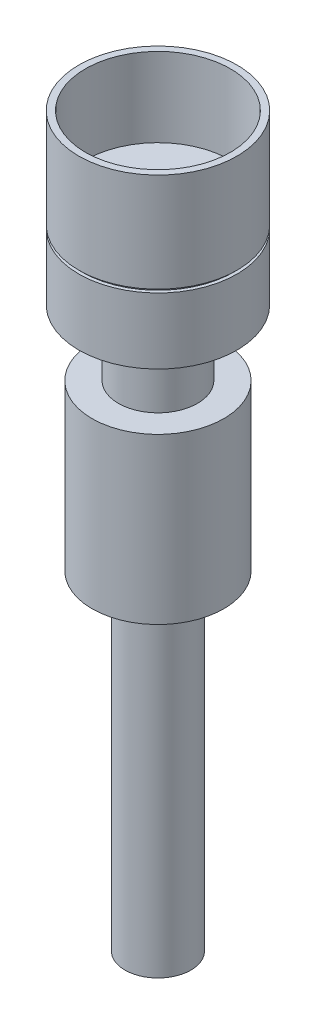
ISO-10303-21;
HEADER;
FILE_DESCRIPTION(('STEP AP214'),'2;1');
FILE_NAME('part.step','',(''),(''),'','','');
FILE_SCHEMA(('AUTOMOTIVE_DESIGN { 1 0 10303 214 1 1 1 1 }'));
ENDSEC;
DATA;
#1=APPLICATION_CONTEXT('core data for automotive mechanical design processes');
#2=APPLICATION_PROTOCOL_DEFINITION('international standard','automotive_design',2000,#1);
#3=PRODUCT_CONTEXT('',#1,'mechanical');
#4=PRODUCT('Part','Part','',(#3));
#5=PRODUCT_RELATED_PRODUCT_CATEGORY('part','',(#4));
#6=PRODUCT_DEFINITION_FORMATION('','',#4);
#7=PRODUCT_DEFINITION_CONTEXT('part definition',#1,'design');
#8=PRODUCT_DEFINITION('design','',#6,#7);
#9=PRODUCT_DEFINITION_SHAPE('','',#8);
#10=(LENGTH_UNIT() NAMED_UNIT(*) SI_UNIT(.MILLI.,.METRE.));
#11=(NAMED_UNIT(*) PLANE_ANGLE_UNIT() SI_UNIT($,.RADIAN.));
#12=(NAMED_UNIT(*) SI_UNIT($,.STERADIAN.) SOLID_ANGLE_UNIT());
#13=UNCERTAINTY_MEASURE_WITH_UNIT(LENGTH_MEASURE(1.E-05),#10,'distance_accuracy_value','');
#14=(GEOMETRIC_REPRESENTATION_CONTEXT(3) GLOBAL_UNCERTAINTY_ASSIGNED_CONTEXT((#13)) GLOBAL_UNIT_ASSIGNED_CONTEXT((#10,
#11,#12)) REPRESENTATION_CONTEXT('',''));
#15=CARTESIAN_POINT('',(0.,0.,0.));
#16=DIRECTION('',(0.,0.,1.));
#17=DIRECTION('',(1.,0.,0.));
#18=AXIS2_PLACEMENT_3D('',#15,#16,#17);
#19=CARTESIAN_POINT('',(0.,46.,0.));
#20=DIRECTION('',(0.,-1.,0.));
#21=DIRECTION('',(0.,0.,-1.));
#22=AXIS2_PLACEMENT_3D('',#19,#20,#21);
#23=CYLINDRICAL_SURFACE('',#22,11.5);
#24=CARTESIAN_POINT('',(0.,45.,0.));
#25=DIRECTION('',(0.,1.,0.));
#26=DIRECTION('',(0.,0.,1.));
#27=AXIS2_PLACEMENT_3D('',#24,#25,#26);
#28=CIRCLE('',#27,11.5);
#29=CARTESIAN_POINT('',(0.,45.,11.5));
#30=VERTEX_POINT('',#29);
#31=EDGE_CURVE('E63',#30,#30,#28,.T.);
#32=ORIENTED_EDGE('',*,*,#31,.T.);
#33=EDGE_LOOP('',(#32));
#34=FACE_BOUND('',#33,.T.);
#35=CARTESIAN_POINT('',(0.,45.5,0.));
#36=DIRECTION('',(0.,1.,0.));
#37=DIRECTION('',(0.,0.,1.));
#38=AXIS2_PLACEMENT_3D('',#35,#36,#37);
#39=CIRCLE('',#38,11.5);
#40=CARTESIAN_POINT('',(0.,45.5,11.5));
#41=VERTEX_POINT('',#40);
#42=EDGE_CURVE('E10',#41,#41,#39,.T.);
#43=ORIENTED_EDGE('',*,*,#42,.F.);
#44=EDGE_LOOP('',(#43));
#45=FACE_BOUND('',#44,.T.);
#46=ADVANCED_FACE('F30',(#34,#45),#23,.T.);
#47=CARTESIAN_POINT('',(0.,45.,0.));
#48=DIRECTION('',(0.,1.,0.));
#49=DIRECTION('',(0.,0.,1.));
#50=AXIS2_PLACEMENT_3D('',#47,#48,#49);
#51=PLANE('',#50);
#52=CARTESIAN_POINT('',(0.,45.,0.));
#53=DIRECTION('',(0.,1.,0.));
#54=DIRECTION('',(0.,0.,1.));
#55=AXIS2_PLACEMENT_3D('',#52,#53,#54);
#56=CIRCLE('',#55,12.);
#57=CARTESIAN_POINT('',(0.,45.,12.));
#58=VERTEX_POINT('',#57);
#59=EDGE_CURVE('E57',#58,#58,#56,.T.);
#60=ORIENTED_EDGE('',*,*,#59,.T.);
#61=EDGE_LOOP('',(#60));
#62=FACE_BOUND('',#61,.T.);
#63=ORIENTED_EDGE('',*,*,#31,.F.);
#64=EDGE_LOOP('',(#63));
#65=FACE_BOUND('',#64,.T.);
#66=ADVANCED_FACE('F112',(#62,#65),#51,.T.);
#67=CARTESIAN_POINT('',(0.,25.,0.));
#68=DIRECTION('',(0.,1.,0.));
#69=DIRECTION('',(0.,0.,1.));
#70=AXIS2_PLACEMENT_3D('',#67,#68,#69);
#71=PLANE('',#70);
#72=CARTESIAN_POINT('',(0.,25.,0.));
#73=DIRECTION('',(0.,1.,0.));
#74=DIRECTION('',(0.,0.,1.));
#75=AXIS2_PLACEMENT_3D('',#72,#73,#74);
#76=CIRCLE('',#75,10.);
#77=CARTESIAN_POINT('',(0.,25.,10.));
#78=VERTEX_POINT('',#77);
#79=EDGE_CURVE('E41',#78,#78,#76,.T.);
#80=ORIENTED_EDGE('',*,*,#79,.T.);
#81=EDGE_LOOP('',(#80));
#82=FACE_BOUND('',#81,.T.);
#83=CARTESIAN_POINT('',(0.,25.,0.));
#84=DIRECTION('',(0.,1.,0.));
#85=DIRECTION('',(0.,0.,1.));
#86=AXIS2_PLACEMENT_3D('',#83,#84,#85);
#87=CIRCLE('',#86,6.);
#88=CARTESIAN_POINT('',(0.,25.,6.));
#89=VERTEX_POINT('',#88);
#90=EDGE_CURVE('E54',#89,#89,#87,.T.);
#91=ORIENTED_EDGE('',*,*,#90,.F.);
#92=EDGE_LOOP('',(#91));
#93=FACE_BOUND('',#92,.T.);
#94=ADVANCED_FACE('F118',(#82,#93),#71,.T.);
#95=CARTESIAN_POINT('',(0.,0.,0.));
#96=DIRECTION('',(0.,1.,0.));
#97=DIRECTION('',(0.,0.,1.));
#98=AXIS2_PLACEMENT_3D('',#95,#96,#97);
#99=PLANE('',#98);
#100=CARTESIAN_POINT('',(0.,0.,0.));
#101=DIRECTION('',(0.,1.,0.));
#102=DIRECTION('',(0.,0.,1.));
#103=AXIS2_PLACEMENT_3D('',#100,#101,#102);
#104=CIRCLE('',#103,10.);
#105=CARTESIAN_POINT('',(0.,0.,10.));
#106=VERTEX_POINT('',#105);
#107=EDGE_CURVE('E45',#106,#106,#104,.T.);
#108=ORIENTED_EDGE('',*,*,#107,.F.);
#109=EDGE_LOOP('',(#108));
#110=FACE_BOUND('',#109,.T.);
#111=CARTESIAN_POINT('',(0.,0.,0.));
#112=DIRECTION('',(0.,1.,0.));
#113=DIRECTION('',(0.,0.,1.));
#114=AXIS2_PLACEMENT_3D('',#111,#112,#113);
#115=CIRCLE('',#114,5.);
#116=CARTESIAN_POINT('',(0.,0.,5.));
#117=VERTEX_POINT('',#116);
#118=EDGE_CURVE('E37',#117,#117,#115,.F.);
#119=ORIENTED_EDGE('',*,*,#118,.F.);
#120=EDGE_LOOP('',(#119));
#121=FACE_BOUND('',#120,.T.);
#122=ADVANCED_FACE('F139',(#110,#121),#99,.F.);
#123=CARTESIAN_POINT('',(0.,25.,0.));
#124=DIRECTION('',(0.,-1.,0.));
#125=DIRECTION('',(0.,0.,-1.));
#126=AXIS2_PLACEMENT_3D('',#123,#124,#125);
#127=CYLINDRICAL_SURFACE('',#126,10.);
#128=ORIENTED_EDGE('',*,*,#79,.F.);
#129=EDGE_LOOP('',(#128));
#130=FACE_BOUND('',#129,.T.);
#131=ORIENTED_EDGE('',*,*,#107,.T.);
#132=EDGE_LOOP('',(#131));
#133=FACE_BOUND('',#132,.T.);
#134=ADVANCED_FACE('F32',(#130,#133),#127,.T.);
#135=CARTESIAN_POINT('',(0.,-50.,0.));
#136=DIRECTION('',(0.,1.,0.));
#137=DIRECTION('',(0.,0.,1.));
#138=AXIS2_PLACEMENT_3D('',#135,#136,#137);
#139=CYLINDRICAL_SURFACE('',#138,5.);
#140=CARTESIAN_POINT('',(0.,-50.,0.));
#141=DIRECTION('',(0.,-1.,0.));
#142=DIRECTION('',(0.,0.,-1.));
#143=AXIS2_PLACEMENT_3D('',#140,#141,#142);
#144=CIRCLE('',#143,5.);
#145=CARTESIAN_POINT('',(0.,-50.,-5.));
#146=VERTEX_POINT('',#145);
#147=EDGE_CURVE('E49',#146,#146,#144,.T.);
#148=ORIENTED_EDGE('',*,*,#147,.F.);
#149=EDGE_LOOP('',(#148));
#150=FACE_BOUND('',#149,.T.);
#151=ORIENTED_EDGE('',*,*,#118,.T.);
#152=EDGE_LOOP('',(#151));
#153=FACE_BOUND('',#152,.T.);
#154=ADVANCED_FACE('F133',(#150,#153),#139,.T.);
#155=CARTESIAN_POINT('',(0.,-50.,0.));
#156=DIRECTION('',(0.,-1.,0.));
#157=DIRECTION('',(0.,0.,-1.));
#158=AXIS2_PLACEMENT_3D('',#155,#156,#157);
#159=PLANE('',#158);
#160=ORIENTED_EDGE('',*,*,#147,.T.);
#161=EDGE_LOOP('',(#160));
#162=FACE_BOUND('',#161,.T.);
#163=ADVANCED_FACE('F129',(#162),#159,.T.);
#164=CARTESIAN_POINT('',(0.,35.,0.));
#165=DIRECTION('',(0.,-1.,0.));
#166=DIRECTION('',(0.,0.,-1.));
#167=AXIS2_PLACEMENT_3D('',#164,#165,#166);
#168=CYLINDRICAL_SURFACE('',#167,6.);
#169=CARTESIAN_POINT('',(0.,35.,0.));
#170=DIRECTION('',(0.,1.,0.));
#171=DIRECTION('',(0.,0.,1.));
#172=AXIS2_PLACEMENT_3D('',#169,#170,#171);
#173=CIRCLE('',#172,6.);
#174=CARTESIAN_POINT('',(0.,35.,6.));
#175=VERTEX_POINT('',#174);
#176=EDGE_CURVE('E53',#175,#175,#173,.T.);
#177=ORIENTED_EDGE('',*,*,#176,.F.);
#178=EDGE_LOOP('',(#177));
#179=FACE_BOUND('',#178,.T.);
#180=ORIENTED_EDGE('',*,*,#90,.T.);
#181=EDGE_LOOP('',(#180));
#182=FACE_BOUND('',#181,.T.);
#183=ADVANCED_FACE('F124',(#179,#182),#168,.T.);
#184=CARTESIAN_POINT('',(0.,35.,0.));
#185=DIRECTION('',(0.,1.,0.));
#186=DIRECTION('',(0.,0.,1.));
#187=AXIS2_PLACEMENT_3D('',#184,#185,#186);
#188=PLANE('',#187);
#189=CARTESIAN_POINT('',(0.,35.,0.));
#190=DIRECTION('',(0.,1.,0.));
#191=DIRECTION('',(0.,0.,1.));
#192=AXIS2_PLACEMENT_3D('',#189,#190,#191);
#193=CIRCLE('',#192,12.);
#194=CARTESIAN_POINT('',(0.,35.,12.));
#195=VERTEX_POINT('',#194);
#196=EDGE_CURVE('E60',#195,#195,#193,.T.);
#197=ORIENTED_EDGE('',*,*,#196,.F.);
#198=EDGE_LOOP('',(#197));
#199=FACE_BOUND('',#198,.T.);
#200=ORIENTED_EDGE('',*,*,#176,.T.);
#201=EDGE_LOOP('',(#200));
#202=FACE_BOUND('',#201,.T.);
#203=ADVANCED_FACE('F108',(#199,#202),#188,.F.);
#204=CARTESIAN_POINT('',(0.,45.,0.));
#205=DIRECTION('',(0.,-1.,0.));
#206=DIRECTION('',(0.,0.,-1.));
#207=AXIS2_PLACEMENT_3D('',#204,#205,#206);
#208=CYLINDRICAL_SURFACE('',#207,12.);
#209=ORIENTED_EDGE('',*,*,#59,.F.);
#210=EDGE_LOOP('',(#209));
#211=FACE_BOUND('',#210,.T.);
#212=ORIENTED_EDGE('',*,*,#196,.T.);
#213=EDGE_LOOP('',(#212));
#214=FACE_BOUND('',#213,.T.);
#215=ADVANCED_FACE('F103',(#211,#214),#208,.T.);
#216=CARTESIAN_POINT('',(0.,45.5,0.));
#217=DIRECTION('',(0.,1.,0.));
#218=DIRECTION('',(0.,0.,1.));
#219=AXIS2_PLACEMENT_3D('',#216,#217,#218);
#220=PLANE('',#219);
#221=CARTESIAN_POINT('',(0.,45.5,0.));
#222=DIRECTION('',(0.,1.,0.));
#223=DIRECTION('',(0.,0.,1.));
#224=AXIS2_PLACEMENT_3D('',#221,#222,#223);
#225=CIRCLE('',#224,12.);
#226=CARTESIAN_POINT('',(0.,45.5,12.));
#227=VERTEX_POINT('',#226);
#228=EDGE_CURVE('E69',#227,#227,#225,.T.);
#229=ORIENTED_EDGE('',*,*,#228,.F.);
#230=EDGE_LOOP('',(#229));
#231=FACE_BOUND('',#230,.T.);
#232=ORIENTED_EDGE('',*,*,#42,.T.);
#233=EDGE_LOOP('',(#232));
#234=FACE_BOUND('',#233,.T.);
#235=ADVANCED_FACE('F98',(#231,#234),#220,.F.);
#236=CARTESIAN_POINT('',(0.,60.5,0.));
#237=DIRECTION('',(0.,-1.,0.));
#238=DIRECTION('',(0.,0.,-1.));
#239=AXIS2_PLACEMENT_3D('',#236,#237,#238);
#240=CYLINDRICAL_SURFACE('',#239,12.);
#241=CARTESIAN_POINT('',(0.,60.5,0.));
#242=DIRECTION('',(0.,1.,0.));
#243=DIRECTION('',(0.,0.,1.));
#244=AXIS2_PLACEMENT_3D('',#241,#242,#243);
#245=CIRCLE('',#244,12.);
#246=CARTESIAN_POINT('',(0.,60.5,12.));
#247=VERTEX_POINT('',#246);
#248=EDGE_CURVE('E68',#247,#247,#245,.T.);
#249=ORIENTED_EDGE('',*,*,#248,.F.);
#250=EDGE_LOOP('',(#249));
#251=FACE_BOUND('',#250,.T.);
#252=ORIENTED_EDGE('',*,*,#228,.T.);
#253=EDGE_LOOP('',(#252));
#254=FACE_BOUND('',#253,.T.);
#255=ADVANCED_FACE('F92',(#251,#254),#240,.T.);
#256=CARTESIAN_POINT('',(0.,60.5,0.));
#257=DIRECTION('',(0.,1.,0.));
#258=DIRECTION('',(0.,0.,1.));
#259=AXIS2_PLACEMENT_3D('',#256,#257,#258);
#260=PLANE('',#259);
#261=CARTESIAN_POINT('',(0.,60.5,0.));
#262=DIRECTION('',(0.,1.,0.));
#263=DIRECTION('',(0.,0.,1.));
#264=AXIS2_PLACEMENT_3D('',#261,#262,#263);
#265=CIRCLE('',#264,11.);
#266=CARTESIAN_POINT('',(0.,60.5,11.));
#267=VERTEX_POINT('',#266);
#268=EDGE_CURVE('E75',#267,#267,#265,.T.);
#269=ORIENTED_EDGE('',*,*,#268,.F.);
#270=EDGE_LOOP('',(#269));
#271=FACE_BOUND('',#270,.T.);
#272=ORIENTED_EDGE('',*,*,#248,.T.);
#273=EDGE_LOOP('',(#272));
#274=FACE_BOUND('',#273,.T.);
#275=ADVANCED_FACE('F86',(#271,#274),#260,.T.);
#276=CARTESIAN_POINT('',(0.,48.5,0.));
#277=DIRECTION('',(0.,1.,0.));
#278=DIRECTION('',(0.,0.,1.));
#279=AXIS2_PLACEMENT_3D('',#276,#277,#278);
#280=CYLINDRICAL_SURFACE('',#279,11.);
#281=CARTESIAN_POINT('',(0.,48.5,0.));
#282=DIRECTION('',(0.,1.,0.));
#283=DIRECTION('',(0.,0.,1.));
#284=AXIS2_PLACEMENT_3D('',#281,#282,#283);
#285=CIRCLE('',#284,11.);
#286=CARTESIAN_POINT('',(0.,48.5,11.));
#287=VERTEX_POINT('',#286);
#288=EDGE_CURVE('E72',#287,#287,#285,.T.);
#289=ORIENTED_EDGE('',*,*,#288,.F.);
#290=EDGE_LOOP('',(#289));
#291=FACE_BOUND('',#290,.T.);
#292=ORIENTED_EDGE('',*,*,#268,.T.);
#293=EDGE_LOOP('',(#292));
#294=FACE_BOUND('',#293,.T.);
#295=ADVANCED_FACE('F83',(#291,#294),#280,.F.);
#296=CARTESIAN_POINT('',(0.,48.5,0.));
#297=DIRECTION('',(0.,1.,0.));
#298=DIRECTION('',(0.,0.,1.));
#299=AXIS2_PLACEMENT_3D('',#296,#297,#298);
#300=PLANE('',#299);
#301=ORIENTED_EDGE('',*,*,#288,.T.);
#302=EDGE_LOOP('',(#301));
#303=FACE_BOUND('',#302,.T.);
#304=ADVANCED_FACE('F81',(#303),#300,.T.);
#305=CLOSED_SHELL('',(#46,#66,#94,#122,#134,#154,#163,#183,#203,#215,#235,#255,#275,#295,#304));
#306=MANIFOLD_SOLID_BREP('B2',#305);
#307=ADVANCED_BREP_SHAPE_REPRESENTATION('',(#18,#306),#14);
#308=SHAPE_DEFINITION_REPRESENTATION(#9,#307);
ENDSEC;
END-ISO-10303-21;
